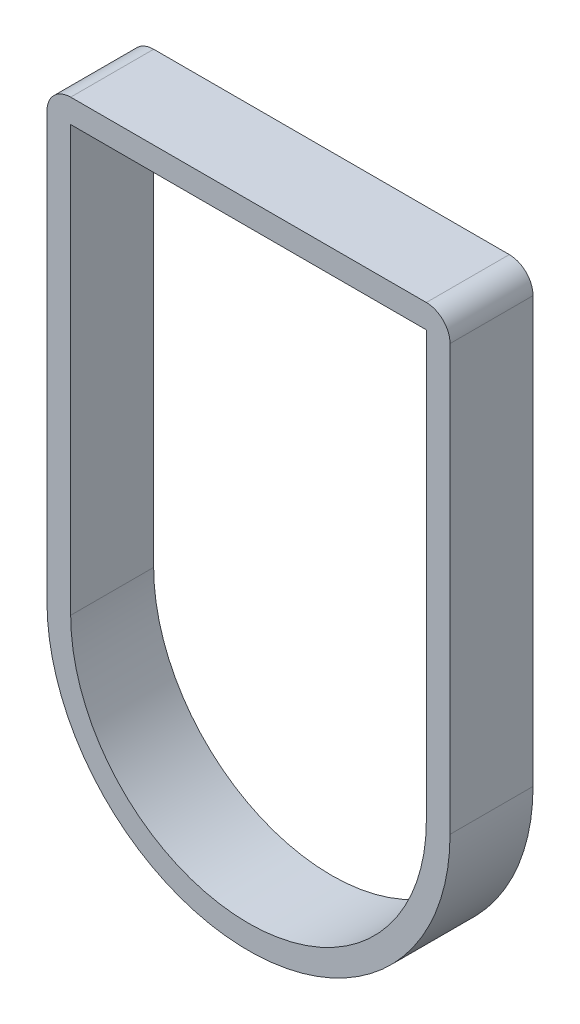
ISO-10303-21;
HEADER;
FILE_DESCRIPTION(('STEP AP214'),'2;1');
FILE_NAME('part.step','',(''),(''),'','','');
FILE_SCHEMA(('AUTOMOTIVE_DESIGN { 1 0 10303 214 1 1 1 1 }'));
ENDSEC;
DATA;
#1=APPLICATION_CONTEXT('core data for automotive mechanical design processes');
#2=APPLICATION_PROTOCOL_DEFINITION('international standard','automotive_design',2000,#1);
#3=PRODUCT_CONTEXT('',#1,'mechanical');
#4=PRODUCT('Part','Part','',(#3));
#5=PRODUCT_RELATED_PRODUCT_CATEGORY('part','',(#4));
#6=PRODUCT_DEFINITION_FORMATION('','',#4);
#7=PRODUCT_DEFINITION_CONTEXT('part definition',#1,'design');
#8=PRODUCT_DEFINITION('design','',#6,#7);
#9=PRODUCT_DEFINITION_SHAPE('','',#8);
#10=(LENGTH_UNIT() NAMED_UNIT(*) SI_UNIT(.MILLI.,.METRE.));
#11=(NAMED_UNIT(*) PLANE_ANGLE_UNIT() SI_UNIT($,.RADIAN.));
#12=(NAMED_UNIT(*) SI_UNIT($,.STERADIAN.) SOLID_ANGLE_UNIT());
#13=UNCERTAINTY_MEASURE_WITH_UNIT(LENGTH_MEASURE(1.E-05),#10,'distance_accuracy_value','');
#14=(GEOMETRIC_REPRESENTATION_CONTEXT(3) GLOBAL_UNCERTAINTY_ASSIGNED_CONTEXT((#13)) GLOBAL_UNIT_ASSIGNED_CONTEXT((#10,
#11,#12)) REPRESENTATION_CONTEXT('',''));
#15=CARTESIAN_POINT('',(0.,0.,0.));
#16=DIRECTION('',(0.,0.,1.));
#17=DIRECTION('',(1.,0.,0.));
#18=AXIS2_PLACEMENT_3D('',#15,#16,#17);
#19=CARTESIAN_POINT('',(16.5000000000002,5.715,0.));
#20=DIRECTION('',(0.,0.,1.));
#21=DIRECTION('',(1.,0.,0.));
#22=AXIS2_PLACEMENT_3D('',#19,#20,#21);
#23=CYLINDRICAL_SURFACE('',#22,1.);
#24=CARTESIAN_POINT('',(16.5000000000002,5.715,3.5));
#25=DIRECTION('',(0.,0.,-1.));
#26=DIRECTION('',(0.,-1.,0.));
#27=AXIS2_PLACEMENT_3D('',#24,#25,#26);
#28=CIRCLE('',#27,1.);
#29=CARTESIAN_POINT('',(16.5000000000002,6.715,3.5));
#30=VERTEX_POINT('',#29);
#31=CARTESIAN_POINT('',(17.5000000000002,5.715,3.5));
#32=VERTEX_POINT('',#31);
#33=EDGE_CURVE('E11',#30,#32,#28,.T.);
#34=ORIENTED_EDGE('',*,*,#33,.T.);
#35=DIRECTION('',(0.,0.,-1.));
#36=VECTOR('',#35,1.);
#37=CARTESIAN_POINT('',(17.5000000000002,5.715,0.));
#38=LINE('',#37,#36);
#39=CARTESIAN_POINT('',(17.5000000000002,5.715,0.));
#40=VERTEX_POINT('',#39);
#41=EDGE_CURVE('E26',#32,#40,#38,.T.);
#42=ORIENTED_EDGE('',*,*,#41,.T.);
#43=CARTESIAN_POINT('',(16.5000000000002,5.715,0.));
#44=DIRECTION('',(0.,0.,1.));
#45=DIRECTION('',(1.,0.,0.));
#46=AXIS2_PLACEMENT_3D('',#43,#44,#45);
#47=CIRCLE('',#46,1.);
#48=CARTESIAN_POINT('',(16.5000000000002,6.715,0.));
#49=VERTEX_POINT('',#48);
#50=EDGE_CURVE('E169',#40,#49,#47,.T.);
#51=ORIENTED_EDGE('',*,*,#50,.T.);
#52=DIRECTION('',(0.,0.,1.));
#53=VECTOR('',#52,1.);
#54=CARTESIAN_POINT('',(16.5000000000002,6.715,0.));
#55=LINE('',#54,#53);
#56=EDGE_CURVE('E162',#49,#30,#55,.T.);
#57=ORIENTED_EDGE('',*,*,#56,.T.);
#58=EDGE_LOOP('',(#34,#42,#51,#57));
#59=FACE_BOUND('',#58,.T.);
#60=ADVANCED_FACE('F16',(#59),#23,.T.);
#61=CARTESIAN_POINT('',(17.5000000000002,6.715,0.));
#62=DIRECTION('',(0.,1.,0.));
#63=DIRECTION('',(-1.,0.,0.));
#64=AXIS2_PLACEMENT_3D('',#61,#62,#63);
#65=PLANE('',#64);
#66=ORIENTED_EDGE('',*,*,#56,.F.);
#67=DIRECTION('',(1.,0.,0.));
#68=VECTOR('',#67,1.);
#69=CARTESIAN_POINT('',(0.500000000000162,6.715,0.));
#70=LINE('',#69,#68);
#71=CARTESIAN_POINT('',(1.50000000000016,6.715,0.));
#72=VERTEX_POINT('',#71);
#73=EDGE_CURVE('E143',#72,#49,#70,.T.);
#74=ORIENTED_EDGE('',*,*,#73,.F.);
#75=DIRECTION('',(0.,0.,-1.));
#76=VECTOR('',#75,1.);
#77=CARTESIAN_POINT('',(1.50000000000016,6.715,0.));
#78=LINE('',#77,#76);
#79=CARTESIAN_POINT('',(1.50000000000016,6.715,3.5));
#80=VERTEX_POINT('',#79);
#81=EDGE_CURVE('E144',#80,#72,#78,.T.);
#82=ORIENTED_EDGE('',*,*,#81,.F.);
#83=DIRECTION('',(-1.,0.,0.));
#84=VECTOR('',#83,1.);
#85=CARTESIAN_POINT('',(0.500000000000162,6.715,3.5));
#86=LINE('',#85,#84);
#87=EDGE_CURVE('E107',#30,#80,#86,.T.);
#88=ORIENTED_EDGE('',*,*,#87,.F.);
#89=EDGE_LOOP('',(#66,#74,#82,#88));
#90=FACE_BOUND('',#89,.T.);
#91=ADVANCED_FACE('F180',(#90),#65,.T.);
#92=CARTESIAN_POINT('',(9.00000000000011,-4.57757593829435,0.));
#93=DIRECTION('',(0.,0.,1.));
#94=DIRECTION('',(1.,0.,0.));
#95=AXIS2_PLACEMENT_3D('',#92,#93,#94);
#96=PLANE('',#95);
#97=DIRECTION('',(-1.,0.,0.));
#98=VECTOR('',#97,1.);
#99=CARTESIAN_POINT('',(12.7500000000001,5.715,0.));
#100=LINE('',#99,#98);
#101=CARTESIAN_POINT('',(16.5000000000002,5.715,0.));
#102=VERTEX_POINT('',#101);
#103=CARTESIAN_POINT('',(1.50000000000016,5.715,0.));
#104=VERTEX_POINT('',#103);
#105=EDGE_CURVE('E160',#102,#104,#100,.T.);
#106=ORIENTED_EDGE('',*,*,#105,.T.);
#107=DIRECTION('',(0.,-1.,0.));
#108=VECTOR('',#107,1.);
#109=CARTESIAN_POINT('',(1.50000000000011,0.56871203085286,0.));
#110=LINE('',#109,#108);
#111=CARTESIAN_POINT('',(1.49999999999999,-12.2101905283833,0.));
#112=VERTEX_POINT('',#111);
#113=EDGE_CURVE('E157',#104,#112,#110,.T.);
#114=ORIENTED_EDGE('',*,*,#113,.T.);
#115=CARTESIAN_POINT('',(8.99999999999999,-12.2101905283833,0.));
#116=DIRECTION('',(0.,0.,1.));
#117=DIRECTION('',(1.,0.,0.));
#118=AXIS2_PLACEMENT_3D('',#115,#116,#117);
#119=CIRCLE('',#118,7.5);
#120=CARTESIAN_POINT('',(16.5,-12.2101905283834,0.));
#121=VERTEX_POINT('',#120);
#122=EDGE_CURVE('E154',#112,#121,#119,.T.);
#123=ORIENTED_EDGE('',*,*,#122,.T.);
#124=DIRECTION('',(0.,1.,0.));
#125=VECTOR('',#124,1.);
#126=CARTESIAN_POINT('',(16.5,-8.3938832333389,0.));
#127=LINE('',#126,#125);
#128=EDGE_CURVE('E152',#121,#102,#127,.T.);
#129=ORIENTED_EDGE('',*,*,#128,.T.);
#130=EDGE_LOOP('',(#106,#114,#123,#129));
#131=FACE_BOUND('',#130,.T.);
#132=ORIENTED_EDGE('',*,*,#50,.F.);
#133=DIRECTION('',(0.,-1.,0.));
#134=VECTOR('',#133,1.);
#135=CARTESIAN_POINT('',(17.5000000000002,6.715,0.));
#136=LINE('',#135,#134);
#137=CARTESIAN_POINT('',(17.5000000000002,-12.2101905283833,0.));
#138=VERTEX_POINT('',#137);
#139=EDGE_CURVE('E149',#40,#138,#136,.T.);
#140=ORIENTED_EDGE('',*,*,#139,.T.);
#141=CARTESIAN_POINT('',(8.99999999999999,-12.2101905283833,0.));
#142=DIRECTION('',(0.,0.,-1.));
#143=DIRECTION('',(0.,-1.,0.));
#144=AXIS2_PLACEMENT_3D('',#141,#142,#143);
#145=CIRCLE('',#144,8.5);
#146=CARTESIAN_POINT('',(0.500000000000165,-12.2101905283833,0.));
#147=VERTEX_POINT('',#146);
#148=EDGE_CURVE('E147',#138,#147,#145,.T.);
#149=ORIENTED_EDGE('',*,*,#148,.T.);
#150=DIRECTION('',(0.,1.,0.));
#151=VECTOR('',#150,1.);
#152=CARTESIAN_POINT('',(0.500000000000165,-12.2101905283833,0.));
#153=LINE('',#152,#151);
#154=CARTESIAN_POINT('',(0.500000000000163,5.715,0.));
#155=VERTEX_POINT('',#154);
#156=EDGE_CURVE('E105',#147,#155,#153,.T.);
#157=ORIENTED_EDGE('',*,*,#156,.T.);
#158=CARTESIAN_POINT('',(1.50000000000016,5.715,0.));
#159=DIRECTION('',(0.,0.,1.));
#160=DIRECTION('',(1.,0.,0.));
#161=AXIS2_PLACEMENT_3D('',#158,#159,#160);
#162=CIRCLE('',#161,1.);
#163=EDGE_CURVE('E141',#72,#155,#162,.T.);
#164=ORIENTED_EDGE('',*,*,#163,.F.);
#165=ORIENTED_EDGE('',*,*,#73,.T.);
#166=EDGE_LOOP('',(#132,#140,#149,#157,#164,#165));
#167=FACE_BOUND('',#166,.T.);
#168=ADVANCED_FACE('F175',(#131,#167),#96,.F.);
#169=CARTESIAN_POINT('',(1.50000000000016,5.715,0.));
#170=DIRECTION('',(0.,0.,1.));
#171=DIRECTION('',(1.,0.,0.));
#172=AXIS2_PLACEMENT_3D('',#169,#170,#171);
#173=CYLINDRICAL_SURFACE('',#172,1.);
#174=CARTESIAN_POINT('',(1.50000000000016,5.715,3.5));
#175=DIRECTION('',(0.,0.,-1.));
#176=DIRECTION('',(0.,-1.,0.));
#177=AXIS2_PLACEMENT_3D('',#174,#175,#176);
#178=CIRCLE('',#177,1.);
#179=CARTESIAN_POINT('',(0.500000000000163,5.715,3.5));
#180=VERTEX_POINT('',#179);
#181=EDGE_CURVE('E114',#180,#80,#178,.T.);
#182=ORIENTED_EDGE('',*,*,#181,.T.);
#183=ORIENTED_EDGE('',*,*,#81,.T.);
#184=ORIENTED_EDGE('',*,*,#163,.T.);
#185=DIRECTION('',(0.,0.,1.));
#186=VECTOR('',#185,1.);
#187=CARTESIAN_POINT('',(0.500000000000163,5.715,0.));
#188=LINE('',#187,#186);
#189=EDGE_CURVE('E139',#155,#180,#188,.T.);
#190=ORIENTED_EDGE('',*,*,#189,.T.);
#191=EDGE_LOOP('',(#182,#183,#184,#190));
#192=FACE_BOUND('',#191,.T.);
#193=ADVANCED_FACE('F183',(#192),#173,.T.);
#194=CARTESIAN_POINT('',(16.5000000000002,5.715,0.));
#195=DIRECTION('',(0.,1.,0.));
#196=DIRECTION('',(0.,0.,1.));
#197=AXIS2_PLACEMENT_3D('',#194,#195,#196);
#198=PLANE('',#197);
#199=ORIENTED_EDGE('',*,*,#105,.F.);
#200=DIRECTION('',(0.,0.,1.));
#201=VECTOR('',#200,1.);
#202=CARTESIAN_POINT('',(16.5000000000002,5.715,0.));
#203=LINE('',#202,#201);
#204=CARTESIAN_POINT('',(16.5000000000002,5.715,3.5));
#205=VERTEX_POINT('',#204);
#206=EDGE_CURVE('E133',#102,#205,#203,.T.);
#207=ORIENTED_EDGE('',*,*,#206,.T.);
#208=DIRECTION('',(1.,0.,0.));
#209=VECTOR('',#208,1.);
#210=CARTESIAN_POINT('',(12.7500000000001,5.715,3.5));
#211=LINE('',#210,#209);
#212=CARTESIAN_POINT('',(1.50000000000016,5.715,3.5));
#213=VERTEX_POINT('',#212);
#214=EDGE_CURVE('E130',#213,#205,#211,.T.);
#215=ORIENTED_EDGE('',*,*,#214,.F.);
#216=DIRECTION('',(0.,0.,1.));
#217=VECTOR('',#216,1.);
#218=CARTESIAN_POINT('',(1.50000000000016,5.715,0.));
#219=LINE('',#218,#217);
#220=EDGE_CURVE('E118',#104,#213,#219,.T.);
#221=ORIENTED_EDGE('',*,*,#220,.F.);
#222=EDGE_LOOP('',(#199,#207,#215,#221));
#223=FACE_BOUND('',#222,.T.);
#224=ADVANCED_FACE('F185',(#223),#198,.F.);
#225=CARTESIAN_POINT('',(16.5,-12.2101905283834,0.));
#226=DIRECTION('',(1.,0.,0.));
#227=DIRECTION('',(0.,1.,0.));
#228=AXIS2_PLACEMENT_3D('',#225,#226,#227);
#229=PLANE('',#228);
#230=ORIENTED_EDGE('',*,*,#128,.F.);
#231=DIRECTION('',(0.,0.,1.));
#232=VECTOR('',#231,1.);
#233=CARTESIAN_POINT('',(16.5,-12.2101905283834,0.));
#234=LINE('',#233,#232);
#235=CARTESIAN_POINT('',(16.5,-12.2101905283834,3.5));
#236=VERTEX_POINT('',#235);
#237=EDGE_CURVE('E128',#121,#236,#234,.T.);
#238=ORIENTED_EDGE('',*,*,#237,.T.);
#239=DIRECTION('',(0.,-1.,0.));
#240=VECTOR('',#239,1.);
#241=CARTESIAN_POINT('',(16.5,-8.3938832333389,3.5));
#242=LINE('',#241,#240);
#243=EDGE_CURVE('E124',#205,#236,#242,.T.);
#244=ORIENTED_EDGE('',*,*,#243,.F.);
#245=ORIENTED_EDGE('',*,*,#206,.F.);
#246=EDGE_LOOP('',(#230,#238,#244,#245));
#247=FACE_BOUND('',#246,.T.);
#248=ADVANCED_FACE('F192',(#247),#229,.F.);
#249=CARTESIAN_POINT('',(8.99999999999999,-12.2101905283833,0.));
#250=DIRECTION('',(0.,0.,1.));
#251=DIRECTION('',(1.,0.,0.));
#252=AXIS2_PLACEMENT_3D('',#249,#250,#251);
#253=CYLINDRICAL_SURFACE('',#252,7.5);
#254=ORIENTED_EDGE('',*,*,#122,.F.);
#255=DIRECTION('',(0.,0.,1.));
#256=VECTOR('',#255,1.);
#257=CARTESIAN_POINT('',(1.49999999999999,-12.2101905283833,0.));
#258=LINE('',#257,#256);
#259=CARTESIAN_POINT('',(1.49999999999999,-12.2101905283833,3.5));
#260=VERTEX_POINT('',#259);
#261=EDGE_CURVE('E125',#112,#260,#258,.T.);
#262=ORIENTED_EDGE('',*,*,#261,.T.);
#263=CARTESIAN_POINT('',(8.99999999999999,-12.2101905283833,3.5));
#264=DIRECTION('',(0.,0.,-1.));
#265=DIRECTION('',(0.,-1.,0.));
#266=AXIS2_PLACEMENT_3D('',#263,#264,#265);
#267=CIRCLE('',#266,7.5);
#268=EDGE_CURVE('E122',#236,#260,#267,.T.);
#269=ORIENTED_EDGE('',*,*,#268,.F.);
#270=ORIENTED_EDGE('',*,*,#237,.F.);
#271=EDGE_LOOP('',(#254,#262,#269,#270));
#272=FACE_BOUND('',#271,.T.);
#273=ADVANCED_FACE('F204',(#272),#253,.F.);
#274=CARTESIAN_POINT('',(1.50000000000016,5.715,0.));
#275=DIRECTION('',(-1.,0.,0.));
#276=DIRECTION('',(0.,-1.,0.));
#277=AXIS2_PLACEMENT_3D('',#274,#275,#276);
#278=PLANE('',#277);
#279=ORIENTED_EDGE('',*,*,#113,.F.);
#280=ORIENTED_EDGE('',*,*,#220,.T.);
#281=DIRECTION('',(0.,1.,0.));
#282=VECTOR('',#281,1.);
#283=CARTESIAN_POINT('',(1.50000000000011,0.56871203085286,3.5));
#284=LINE('',#283,#282);
#285=EDGE_CURVE('E119',#260,#213,#284,.T.);
#286=ORIENTED_EDGE('',*,*,#285,.F.);
#287=ORIENTED_EDGE('',*,*,#261,.F.);
#288=EDGE_LOOP('',(#279,#280,#286,#287));
#289=FACE_BOUND('',#288,.T.);
#290=ADVANCED_FACE('F206',(#289),#278,.F.);
#291=CARTESIAN_POINT('',(8.99999999999999,-12.2101905283833,0.));
#292=DIRECTION('',(0.,0.,1.));
#293=DIRECTION('',(1.,0.,0.));
#294=AXIS2_PLACEMENT_3D('',#291,#292,#293);
#295=CYLINDRICAL_SURFACE('',#294,8.5);
#296=ORIENTED_EDGE('',*,*,#148,.F.);
#297=DIRECTION('',(0.,0.,1.));
#298=VECTOR('',#297,1.);
#299=CARTESIAN_POINT('',(17.5000000000002,-12.2101905283833,0.));
#300=LINE('',#299,#298);
#301=CARTESIAN_POINT('',(17.5000000000002,-12.2101905283833,3.5));
#302=VERTEX_POINT('',#301);
#303=EDGE_CURVE('E97',#138,#302,#300,.T.);
#304=ORIENTED_EDGE('',*,*,#303,.T.);
#305=CARTESIAN_POINT('',(8.99999999999999,-12.2101905283833,3.5));
#306=DIRECTION('',(0.,0.,1.));
#307=DIRECTION('',(1.,0.,0.));
#308=AXIS2_PLACEMENT_3D('',#305,#306,#307);
#309=CIRCLE('',#308,8.5);
#310=CARTESIAN_POINT('',(0.500000000000165,-12.2101905283833,3.5));
#311=VERTEX_POINT('',#310);
#312=EDGE_CURVE('E90',#311,#302,#309,.T.);
#313=ORIENTED_EDGE('',*,*,#312,.F.);
#314=DIRECTION('',(0.,0.,1.));
#315=VECTOR('',#314,1.);
#316=CARTESIAN_POINT('',(0.500000000000165,-12.2101905283833,0.));
#317=LINE('',#316,#315);
#318=EDGE_CURVE('E95',#147,#311,#317,.T.);
#319=ORIENTED_EDGE('',*,*,#318,.F.);
#320=EDGE_LOOP('',(#296,#304,#313,#319));
#321=FACE_BOUND('',#320,.T.);
#322=ADVANCED_FACE('F18',(#321),#295,.T.);
#323=CARTESIAN_POINT('',(0.500000000000162,6.715,0.));
#324=DIRECTION('',(-1.,0.,0.));
#325=DIRECTION('',(0.,-1.,0.));
#326=AXIS2_PLACEMENT_3D('',#323,#324,#325);
#327=PLANE('',#326);
#328=ORIENTED_EDGE('',*,*,#189,.F.);
#329=ORIENTED_EDGE('',*,*,#156,.F.);
#330=ORIENTED_EDGE('',*,*,#318,.T.);
#331=DIRECTION('',(0.,-1.,0.));
#332=VECTOR('',#331,1.);
#333=CARTESIAN_POINT('',(0.500000000000165,-12.2101905283833,3.5));
#334=LINE('',#333,#332);
#335=EDGE_CURVE('E98',#180,#311,#334,.T.);
#336=ORIENTED_EDGE('',*,*,#335,.F.);
#337=EDGE_LOOP('',(#328,#329,#330,#336));
#338=FACE_BOUND('',#337,.T.);
#339=ADVANCED_FACE('F103',(#338),#327,.T.);
#340=CARTESIAN_POINT('',(17.5000000000002,-12.2101905283833,0.));
#341=DIRECTION('',(1.,0.,0.));
#342=DIRECTION('',(0.,1.,0.));
#343=AXIS2_PLACEMENT_3D('',#340,#341,#342);
#344=PLANE('',#343);
#345=ORIENTED_EDGE('',*,*,#41,.F.);
#346=DIRECTION('',(0.,1.,0.));
#347=VECTOR('',#346,1.);
#348=CARTESIAN_POINT('',(17.5000000000002,6.715,3.5));
#349=LINE('',#348,#347);
#350=EDGE_CURVE('E20',#302,#32,#349,.T.);
#351=ORIENTED_EDGE('',*,*,#350,.F.);
#352=ORIENTED_EDGE('',*,*,#303,.F.);
#353=ORIENTED_EDGE('',*,*,#139,.F.);
#354=EDGE_LOOP('',(#345,#351,#352,#353));
#355=FACE_BOUND('',#354,.T.);
#356=ADVANCED_FACE('F173',(#355),#344,.T.);
#357=CARTESIAN_POINT('',(9.00000000000011,-4.57757593829435,3.5));
#358=DIRECTION('',(0.,0.,1.));
#359=DIRECTION('',(1.,0.,0.));
#360=AXIS2_PLACEMENT_3D('',#357,#358,#359);
#361=PLANE('',#360);
#362=ORIENTED_EDGE('',*,*,#33,.F.);
#363=ORIENTED_EDGE('',*,*,#87,.T.);
#364=ORIENTED_EDGE('',*,*,#181,.F.);
#365=ORIENTED_EDGE('',*,*,#335,.T.);
#366=ORIENTED_EDGE('',*,*,#312,.T.);
#367=ORIENTED_EDGE('',*,*,#350,.T.);
#368=EDGE_LOOP('',(#362,#363,#364,#365,#366,#367));
#369=FACE_BOUND('',#368,.T.);
#370=ORIENTED_EDGE('',*,*,#214,.T.);
#371=ORIENTED_EDGE('',*,*,#243,.T.);
#372=ORIENTED_EDGE('',*,*,#268,.T.);
#373=ORIENTED_EDGE('',*,*,#285,.T.);
#374=EDGE_LOOP('',(#370,#371,#372,#373));
#375=FACE_BOUND('',#374,.T.);
#376=ADVANCED_FACE('F111',(#369,#375),#361,.T.);
#377=CLOSED_SHELL('',(#60,#91,#168,#193,#224,#248,#273,#290,#322,#339,#356,#376));
#378=MANIFOLD_SOLID_BREP('B1',#377);
#379=ADVANCED_BREP_SHAPE_REPRESENTATION('',(#18,#378),#14);
#380=SHAPE_DEFINITION_REPRESENTATION(#9,#379);
ENDSEC;
END-ISO-10303-21;
